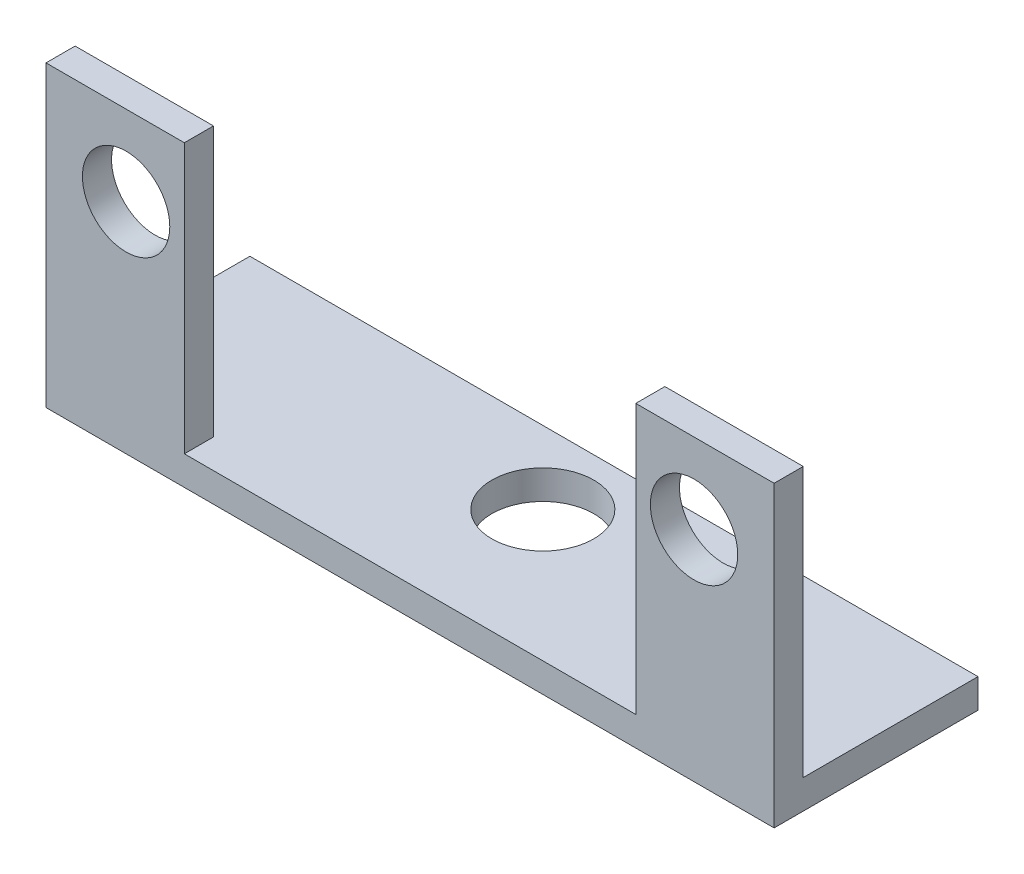
ISO-10303-21;
HEADER;
FILE_DESCRIPTION(('STEP AP214'),'2;1');
FILE_NAME('part.step','',(''),(''),'','','');
FILE_SCHEMA(('AUTOMOTIVE_DESIGN { 1 0 10303 214 1 1 1 1 }'));
ENDSEC;
DATA;
#1=APPLICATION_CONTEXT('core data for automotive mechanical design processes');
#2=APPLICATION_PROTOCOL_DEFINITION('international standard','automotive_design',2000,#1);
#3=PRODUCT_CONTEXT('',#1,'mechanical');
#4=PRODUCT('Part','Part','',(#3));
#5=PRODUCT_RELATED_PRODUCT_CATEGORY('part','',(#4));
#6=PRODUCT_DEFINITION_FORMATION('','',#4);
#7=PRODUCT_DEFINITION_CONTEXT('part definition',#1,'design');
#8=PRODUCT_DEFINITION('design','',#6,#7);
#9=PRODUCT_DEFINITION_SHAPE('','',#8);
#10=(LENGTH_UNIT() NAMED_UNIT(*) SI_UNIT(.MILLI.,.METRE.));
#11=(NAMED_UNIT(*) PLANE_ANGLE_UNIT() SI_UNIT($,.RADIAN.));
#12=(NAMED_UNIT(*) SI_UNIT($,.STERADIAN.) SOLID_ANGLE_UNIT());
#13=UNCERTAINTY_MEASURE_WITH_UNIT(LENGTH_MEASURE(1.E-05),#10,'distance_accuracy_value','');
#14=(GEOMETRIC_REPRESENTATION_CONTEXT(3) GLOBAL_UNCERTAINTY_ASSIGNED_CONTEXT((#13)) GLOBAL_UNIT_ASSIGNED_CONTEXT((#10,
#11,#12)) REPRESENTATION_CONTEXT('',''));
#15=CARTESIAN_POINT('',(0.,0.,0.));
#16=DIRECTION('',(0.,0.,1.));
#17=DIRECTION('',(1.,0.,0.));
#18=AXIS2_PLACEMENT_3D('',#15,#16,#17);
#19=CARTESIAN_POINT('',(0.,0.,0.));
#20=DIRECTION('',(0.,0.,1.));
#21=DIRECTION('',(1.,0.,0.));
#22=AXIS2_PLACEMENT_3D('',#19,#20,#21);
#23=PLANE('',#22);
#24=CARTESIAN_POINT('',(-0.18065955140499,2.83145936235665,0.));
#25=DIRECTION('',(0.,0.,1.));
#26=DIRECTION('',(1.,0.,0.));
#27=AXIS2_PLACEMENT_3D('',#24,#25,#26);
#28=CIRCLE('',#27,1.5);
#29=CARTESIAN_POINT('',(1.31934044859501,2.83145936235665,0.));
#30=VERTEX_POINT('',#29);
#31=EDGE_CURVE('E223',#30,#30,#28,.T.);
#32=ORIENTED_EDGE('',*,*,#31,.T.);
#33=EDGE_LOOP('',(#32));
#34=FACE_BOUND('',#33,.T.);
#35=DIRECTION('',(1.,0.,0.));
#36=VECTOR('',#35,1.);
#37=CARTESIAN_POINT('',(22.069340448595,-3.66854063764335,0.));
#38=LINE('',#37,#36);
#39=CARTESIAN_POINT('',(-2.93065955140499,-3.66854063764335,0.));
#40=VERTEX_POINT('',#39);
#41=CARTESIAN_POINT('',(1.81934044859501,-3.66854063764335,0.));
#42=VERTEX_POINT('',#41);
#43=EDGE_CURVE('E50',#40,#42,#38,.T.);
#44=ORIENTED_EDGE('',*,*,#43,.F.);
#45=DIRECTION('',(0.,-1.,0.));
#46=VECTOR('',#45,1.);
#47=CARTESIAN_POINT('',(-2.93065955140499,5.58145936235664,0.));
#48=LINE('',#47,#46);
#49=CARTESIAN_POINT('',(-2.93065955140499,5.58145936235664,0.));
#50=VERTEX_POINT('',#49);
#51=EDGE_CURVE('E151',#50,#40,#48,.T.);
#52=ORIENTED_EDGE('',*,*,#51,.F.);
#53=DIRECTION('',(-1.,0.,0.));
#54=VECTOR('',#53,1.);
#55=CARTESIAN_POINT('',(1.81934044859501,5.58145936235665,0.));
#56=LINE('',#55,#54);
#57=CARTESIAN_POINT('',(1.81934044859501,5.58145936235665,0.));
#58=VERTEX_POINT('',#57);
#59=EDGE_CURVE('E147',#58,#50,#56,.T.);
#60=ORIENTED_EDGE('',*,*,#59,.F.);
#61=DIRECTION('',(0.,1.,0.));
#62=VECTOR('',#61,1.);
#63=CARTESIAN_POINT('',(1.81934044859501,-3.66854063764335,0.));
#64=LINE('',#63,#62);
#65=EDGE_CURVE('E89',#42,#58,#64,.T.);
#66=ORIENTED_EDGE('',*,*,#65,.F.);
#67=EDGE_LOOP('',(#44,#52,#60,#66));
#68=FACE_BOUND('',#67,.T.);
#69=ADVANCED_FACE('F39',(#34,#68),#23,.F.);
#70=CARTESIAN_POINT('',(19.319340448595,2.83145936235665,0.));
#71=DIRECTION('',(0.,0.,1.));
#72=DIRECTION('',(1.,0.,0.));
#73=AXIS2_PLACEMENT_3D('',#70,#71,#72);
#74=CIRCLE('',#73,1.5);
#75=CARTESIAN_POINT('',(20.819340448595,2.83145936235665,0.));
#76=VERTEX_POINT('',#75);
#77=EDGE_CURVE('E218',#76,#76,#74,.T.);
#78=ORIENTED_EDGE('',*,*,#77,.T.);
#79=EDGE_LOOP('',(#78));
#80=FACE_BOUND('',#79,.T.);
#81=CARTESIAN_POINT('',(17.319340448595,-3.66854063764335,0.));
#82=VERTEX_POINT('',#81);
#83=CARTESIAN_POINT('',(22.069340448595,-3.66854063764335,0.));
#84=VERTEX_POINT('',#83);
#85=EDGE_CURVE('E11',#82,#84,#38,.T.);
#86=ORIENTED_EDGE('',*,*,#85,.F.);
#87=DIRECTION('',(0.,-1.,0.));
#88=VECTOR('',#87,1.);
#89=CARTESIAN_POINT('',(17.319340448595,5.58145936235665,0.));
#90=LINE('',#89,#88);
#91=CARTESIAN_POINT('',(17.319340448595,5.58145936235665,0.));
#92=VERTEX_POINT('',#91);
#93=EDGE_CURVE('E133',#92,#82,#90,.T.);
#94=ORIENTED_EDGE('',*,*,#93,.F.);
#95=DIRECTION('',(-1.,0.,0.));
#96=VECTOR('',#95,1.);
#97=CARTESIAN_POINT('',(22.069340448595,5.58145936235665,0.));
#98=LINE('',#97,#96);
#99=CARTESIAN_POINT('',(22.069340448595,5.58145936235665,0.));
#100=VERTEX_POINT('',#99);
#101=EDGE_CURVE('E158',#100,#92,#98,.T.);
#102=ORIENTED_EDGE('',*,*,#101,.F.);
#103=DIRECTION('',(0.,1.,0.));
#104=VECTOR('',#103,1.);
#105=CARTESIAN_POINT('',(22.069340448595,-4.66854063764335,0.));
#106=LINE('',#105,#104);
#107=EDGE_CURVE('E155',#84,#100,#106,.T.);
#108=ORIENTED_EDGE('',*,*,#107,.F.);
#109=EDGE_LOOP('',(#86,#94,#102,#108));
#110=FACE_BOUND('',#109,.T.);
#111=ADVANCED_FACE('F272',(#80,#110),#23,.F.);
#112=CARTESIAN_POINT('',(0.,0.,1.));
#113=DIRECTION('',(0.,0.,1.));
#114=DIRECTION('',(1.,0.,0.));
#115=AXIS2_PLACEMENT_3D('',#112,#113,#114);
#116=PLANE('',#115);
#117=CARTESIAN_POINT('',(-0.18065955140499,2.83145936235665,1.));
#118=DIRECTION('',(0.,0.,1.));
#119=DIRECTION('',(1.,0.,0.));
#120=AXIS2_PLACEMENT_3D('',#117,#118,#119);
#121=CIRCLE('',#120,1.5);
#122=CARTESIAN_POINT('',(1.31934044859501,2.83145936235665,1.));
#123=VERTEX_POINT('',#122);
#124=EDGE_CURVE('E152',#123,#123,#121,.T.);
#125=ORIENTED_EDGE('',*,*,#124,.F.);
#126=EDGE_LOOP('',(#125));
#127=FACE_BOUND('',#126,.T.);
#128=DIRECTION('',(-1.,0.,0.));
#129=VECTOR('',#128,1.);
#130=CARTESIAN_POINT('',(1.81934044859501,5.58145936235665,1.));
#131=LINE('',#130,#129);
#132=CARTESIAN_POINT('',(1.81934044859501,5.58145936235665,1.));
#133=VERTEX_POINT('',#132);
#134=CARTESIAN_POINT('',(-2.93065955140499,5.58145936235664,1.));
#135=VERTEX_POINT('',#134);
#136=EDGE_CURVE('E165',#133,#135,#131,.T.);
#137=ORIENTED_EDGE('',*,*,#136,.T.);
#138=DIRECTION('',(0.,-1.,0.));
#139=VECTOR('',#138,1.);
#140=CARTESIAN_POINT('',(-2.93065955140499,5.58145936235664,1.));
#141=LINE('',#140,#139);
#142=CARTESIAN_POINT('',(-2.93065955140499,-4.66854063764335,1.));
#143=VERTEX_POINT('',#142);
#144=EDGE_CURVE('E98',#135,#143,#141,.T.);
#145=ORIENTED_EDGE('',*,*,#144,.T.);
#146=DIRECTION('',(1.,0.,0.));
#147=VECTOR('',#146,1.);
#148=CARTESIAN_POINT('',(-2.93065955140499,-4.66854063764335,1.));
#149=LINE('',#148,#147);
#150=CARTESIAN_POINT('',(22.069340448595,-4.66854063764335,1.));
#151=VERTEX_POINT('',#150);
#152=EDGE_CURVE('E237',#143,#151,#149,.T.);
#153=ORIENTED_EDGE('',*,*,#152,.T.);
#154=DIRECTION('',(0.,1.,0.));
#155=VECTOR('',#154,1.);
#156=CARTESIAN_POINT('',(22.069340448595,-4.66854063764335,1.));
#157=LINE('',#156,#155);
#158=CARTESIAN_POINT('',(22.069340448595,5.58145936235665,1.));
#159=VERTEX_POINT('',#158);
#160=EDGE_CURVE('E240',#151,#159,#157,.T.);
#161=ORIENTED_EDGE('',*,*,#160,.T.);
#162=DIRECTION('',(-1.,0.,0.));
#163=VECTOR('',#162,1.);
#164=CARTESIAN_POINT('',(22.069340448595,5.58145936235665,1.));
#165=LINE('',#164,#163);
#166=CARTESIAN_POINT('',(17.319340448595,5.58145936235665,1.));
#167=VERTEX_POINT('',#166);
#168=EDGE_CURVE('E122',#159,#167,#165,.T.);
#169=ORIENTED_EDGE('',*,*,#168,.T.);
#170=DIRECTION('',(0.,-1.,0.));
#171=VECTOR('',#170,1.);
#172=CARTESIAN_POINT('',(17.319340448595,5.58145936235665,1.));
#173=LINE('',#172,#171);
#174=CARTESIAN_POINT('',(17.319340448595,-3.66854063764335,1.));
#175=VERTEX_POINT('',#174);
#176=EDGE_CURVE('E114',#167,#175,#173,.T.);
#177=ORIENTED_EDGE('',*,*,#176,.T.);
#178=DIRECTION('',(-1.,0.,0.));
#179=VECTOR('',#178,1.);
#180=CARTESIAN_POINT('',(17.319340448595,-3.66854063764335,1.));
#181=LINE('',#180,#179);
#182=CARTESIAN_POINT('',(1.81934044859501,-3.66854063764335,1.));
#183=VERTEX_POINT('',#182);
#184=EDGE_CURVE('E119',#175,#183,#181,.T.);
#185=ORIENTED_EDGE('',*,*,#184,.T.);
#186=DIRECTION('',(0.,1.,0.));
#187=VECTOR('',#186,1.);
#188=CARTESIAN_POINT('',(1.81934044859501,-3.66854063764335,1.));
#189=LINE('',#188,#187);
#190=EDGE_CURVE('E65',#183,#133,#189,.T.);
#191=ORIENTED_EDGE('',*,*,#190,.T.);
#192=EDGE_LOOP('',(#137,#145,#153,#161,#169,#177,#185,#191));
#193=FACE_BOUND('',#192,.T.);
#194=CARTESIAN_POINT('',(19.319340448595,2.83145936235665,1.));
#195=DIRECTION('',(0.,0.,1.));
#196=DIRECTION('',(1.,0.,0.));
#197=AXIS2_PLACEMENT_3D('',#194,#195,#196);
#198=CIRCLE('',#197,1.5);
#199=CARTESIAN_POINT('',(20.819340448595,2.83145936235665,1.));
#200=VERTEX_POINT('',#199);
#201=EDGE_CURVE('E219',#200,#200,#198,.T.);
#202=ORIENTED_EDGE('',*,*,#201,.F.);
#203=EDGE_LOOP('',(#202));
#204=FACE_BOUND('',#203,.T.);
#205=ADVANCED_FACE('F116',(#127,#193,#204),#116,.T.);
#206=CARTESIAN_POINT('',(1.81934044859501,5.58145936235665,1.));
#207=DIRECTION('',(0.,-1.,0.));
#208=DIRECTION('',(1.,0.,0.));
#209=AXIS2_PLACEMENT_3D('',#206,#207,#208);
#210=PLANE('',#209);
#211=ORIENTED_EDGE('',*,*,#59,.T.);
#212=DIRECTION('',(0.,0.,-1.));
#213=VECTOR('',#212,1.);
#214=CARTESIAN_POINT('',(-2.93065955140499,5.58145936235664,1.));
#215=LINE('',#214,#213);
#216=EDGE_CURVE('E43',#135,#50,#215,.T.);
#217=ORIENTED_EDGE('',*,*,#216,.F.);
#218=ORIENTED_EDGE('',*,*,#136,.F.);
#219=DIRECTION('',(0.,0.,-1.));
#220=VECTOR('',#219,1.);
#221=CARTESIAN_POINT('',(1.81934044859501,5.58145936235665,1.));
#222=LINE('',#221,#220);
#223=EDGE_CURVE('E143',#133,#58,#222,.T.);
#224=ORIENTED_EDGE('',*,*,#223,.T.);
#225=EDGE_LOOP('',(#211,#217,#218,#224));
#226=FACE_BOUND('',#225,.T.);
#227=ADVANCED_FACE('F41',(#226),#210,.F.);
#228=CARTESIAN_POINT('',(-2.93065955140499,5.58145936235664,1.));
#229=DIRECTION('',(1.,0.,0.));
#230=DIRECTION('',(0.,1.,0.));
#231=AXIS2_PLACEMENT_3D('',#228,#229,#230);
#232=PLANE('',#231);
#233=ORIENTED_EDGE('',*,*,#51,.T.);
#234=DIRECTION('',(0.,0.,1.));
#235=VECTOR('',#234,1.);
#236=CARTESIAN_POINT('',(-2.93065955140499,-3.66854063764335,-6.));
#237=LINE('',#236,#235);
#238=CARTESIAN_POINT('',(-2.93065955140499,-3.66854063764335,-6.));
#239=VERTEX_POINT('',#238);
#240=EDGE_CURVE('E196',#239,#40,#237,.T.);
#241=ORIENTED_EDGE('',*,*,#240,.F.);
#242=DIRECTION('',(0.,1.,0.));
#243=VECTOR('',#242,1.);
#244=CARTESIAN_POINT('',(-2.93065955140499,-4.66854063764335,-6.));
#245=LINE('',#244,#243);
#246=CARTESIAN_POINT('',(-2.93065955140499,-4.66854063764335,-6.));
#247=VERTEX_POINT('',#246);
#248=EDGE_CURVE('E246',#247,#239,#245,.T.);
#249=ORIENTED_EDGE('',*,*,#248,.F.);
#250=DIRECTION('',(0.,0.,-1.));
#251=VECTOR('',#250,1.);
#252=CARTESIAN_POINT('',(-2.93065955140499,-4.66854063764335,1.));
#253=LINE('',#252,#251);
#254=EDGE_CURVE('E179',#143,#247,#253,.T.);
#255=ORIENTED_EDGE('',*,*,#254,.F.);
#256=ORIENTED_EDGE('',*,*,#144,.F.);
#257=ORIENTED_EDGE('',*,*,#216,.T.);
#258=EDGE_LOOP('',(#233,#241,#249,#255,#256,#257));
#259=FACE_BOUND('',#258,.T.);
#260=ADVANCED_FACE('F189',(#259),#232,.F.);
#261=CARTESIAN_POINT('',(-2.93065955140499,-4.66854063764335,1.));
#262=DIRECTION('',(0.,1.,0.));
#263=DIRECTION('',(-1.,0.,0.));
#264=AXIS2_PLACEMENT_3D('',#261,#262,#263);
#265=PLANE('',#264);
#266=CARTESIAN_POINT('',(9.62794513319409,-4.66854063764335,-3.5));
#267=DIRECTION('',(0.,1.,0.));
#268=DIRECTION('',(-1.,0.,0.));
#269=AXIS2_PLACEMENT_3D('',#266,#267,#268);
#270=CIRCLE('',#269,1.75);
#271=CARTESIAN_POINT('',(7.87794513319409,-4.66854063764335,-3.5));
#272=VERTEX_POINT('',#271);
#273=EDGE_CURVE('E199',#272,#272,#270,.T.);
#274=ORIENTED_EDGE('',*,*,#273,.T.);
#275=EDGE_LOOP('',(#274));
#276=FACE_BOUND('',#275,.T.);
#277=ORIENTED_EDGE('',*,*,#254,.T.);
#278=DIRECTION('',(-1.,0.,0.));
#279=VECTOR('',#278,1.);
#280=CARTESIAN_POINT('',(22.069340448595,-4.66854063764335,-6.));
#281=LINE('',#280,#279);
#282=CARTESIAN_POINT('',(22.069340448595,-4.66854063764335,-6.));
#283=VERTEX_POINT('',#282);
#284=EDGE_CURVE('E203',#283,#247,#281,.T.);
#285=ORIENTED_EDGE('',*,*,#284,.F.);
#286=DIRECTION('',(0.,0.,-1.));
#287=VECTOR('',#286,1.);
#288=CARTESIAN_POINT('',(22.069340448595,-4.66854063764335,1.));
#289=LINE('',#288,#287);
#290=EDGE_CURVE('E176',#151,#283,#289,.T.);
#291=ORIENTED_EDGE('',*,*,#290,.F.);
#292=ORIENTED_EDGE('',*,*,#152,.F.);
#293=EDGE_LOOP('',(#277,#285,#291,#292));
#294=FACE_BOUND('',#293,.T.);
#295=ADVANCED_FACE('F333',(#276,#294),#265,.F.);
#296=CARTESIAN_POINT('',(22.069340448595,-4.66854063764335,1.));
#297=DIRECTION('',(-1.,0.,0.));
#298=DIRECTION('',(0.,0.,1.));
#299=AXIS2_PLACEMENT_3D('',#296,#297,#298);
#300=PLANE('',#299);
#301=ORIENTED_EDGE('',*,*,#290,.T.);
#302=DIRECTION('',(0.,-1.,0.));
#303=VECTOR('',#302,1.);
#304=CARTESIAN_POINT('',(22.069340448595,-4.66854063764335,-6.));
#305=LINE('',#304,#303);
#306=CARTESIAN_POINT('',(22.069340448595,-3.66854063764335,-6.));
#307=VERTEX_POINT('',#306);
#308=EDGE_CURVE('E198',#307,#283,#305,.T.);
#309=ORIENTED_EDGE('',*,*,#308,.F.);
#310=DIRECTION('',(0.,0.,1.));
#311=VECTOR('',#310,1.);
#312=CARTESIAN_POINT('',(22.069340448595,-3.66854063764335,-6.));
#313=LINE('',#312,#311);
#314=EDGE_CURVE('E212',#307,#84,#313,.T.);
#315=ORIENTED_EDGE('',*,*,#314,.T.);
#316=ORIENTED_EDGE('',*,*,#107,.T.);
#317=DIRECTION('',(0.,0.,-1.));
#318=VECTOR('',#317,1.);
#319=CARTESIAN_POINT('',(22.069340448595,5.58145936235665,1.));
#320=LINE('',#319,#318);
#321=EDGE_CURVE('E172',#159,#100,#320,.T.);
#322=ORIENTED_EDGE('',*,*,#321,.F.);
#323=ORIENTED_EDGE('',*,*,#160,.F.);
#324=EDGE_LOOP('',(#301,#309,#315,#316,#322,#323));
#325=FACE_BOUND('',#324,.T.);
#326=ADVANCED_FACE('F328',(#325),#300,.F.);
#327=CARTESIAN_POINT('',(22.069340448595,5.58145936235665,1.));
#328=DIRECTION('',(0.,-1.,0.));
#329=DIRECTION('',(1.,0.,0.));
#330=AXIS2_PLACEMENT_3D('',#327,#328,#329);
#331=PLANE('',#330);
#332=ORIENTED_EDGE('',*,*,#101,.T.);
#333=DIRECTION('',(0.,0.,-1.));
#334=VECTOR('',#333,1.);
#335=CARTESIAN_POINT('',(17.319340448595,5.58145936235665,1.));
#336=LINE('',#335,#334);
#337=EDGE_CURVE('E136',#167,#92,#336,.T.);
#338=ORIENTED_EDGE('',*,*,#337,.F.);
#339=ORIENTED_EDGE('',*,*,#168,.F.);
#340=ORIENTED_EDGE('',*,*,#321,.T.);
#341=EDGE_LOOP('',(#332,#338,#339,#340));
#342=FACE_BOUND('',#341,.T.);
#343=ADVANCED_FACE('F269',(#342),#331,.F.);
#344=CARTESIAN_POINT('',(17.319340448595,5.58145936235665,1.));
#345=DIRECTION('',(1.,0.,0.));
#346=DIRECTION('',(0.,0.,-1.));
#347=AXIS2_PLACEMENT_3D('',#344,#345,#346);
#348=PLANE('',#347);
#349=ORIENTED_EDGE('',*,*,#93,.T.);
#350=DIRECTION('',(0.,0.,-1.));
#351=VECTOR('',#350,1.);
#352=CARTESIAN_POINT('',(17.319340448595,-3.66854063764335,1.));
#353=LINE('',#352,#351);
#354=EDGE_CURVE('E130',#175,#82,#353,.T.);
#355=ORIENTED_EDGE('',*,*,#354,.F.);
#356=ORIENTED_EDGE('',*,*,#176,.F.);
#357=ORIENTED_EDGE('',*,*,#337,.T.);
#358=EDGE_LOOP('',(#349,#355,#356,#357));
#359=FACE_BOUND('',#358,.T.);
#360=ADVANCED_FACE('F131',(#359),#348,.F.);
#361=CARTESIAN_POINT('',(17.319340448595,-3.66854063764335,1.));
#362=DIRECTION('',(0.,-1.,0.));
#363=DIRECTION('',(1.,0.,0.));
#364=AXIS2_PLACEMENT_3D('',#361,#362,#363);
#365=PLANE('',#364);
#366=CARTESIAN_POINT('',(9.62794513319409,-3.66854063764335,-3.5));
#367=DIRECTION('',(0.,1.,0.));
#368=DIRECTION('',(-1.,0.,0.));
#369=AXIS2_PLACEMENT_3D('',#366,#367,#368);
#370=CIRCLE('',#369,1.75);
#371=CARTESIAN_POINT('',(7.87794513319409,-3.66854063764335,-3.5));
#372=VERTEX_POINT('',#371);
#373=EDGE_CURVE('E206',#372,#372,#370,.T.);
#374=ORIENTED_EDGE('',*,*,#373,.F.);
#375=EDGE_LOOP('',(#374));
#376=FACE_BOUND('',#375,.T.);
#377=ORIENTED_EDGE('',*,*,#354,.T.);
#378=ORIENTED_EDGE('',*,*,#85,.T.);
#379=ORIENTED_EDGE('',*,*,#314,.F.);
#380=DIRECTION('',(1.,0.,0.));
#381=VECTOR('',#380,1.);
#382=CARTESIAN_POINT('',(22.069340448595,-3.66854063764335,-6.));
#383=LINE('',#382,#381);
#384=EDGE_CURVE('E210',#239,#307,#383,.T.);
#385=ORIENTED_EDGE('',*,*,#384,.F.);
#386=ORIENTED_EDGE('',*,*,#240,.T.);
#387=ORIENTED_EDGE('',*,*,#43,.T.);
#388=DIRECTION('',(0.,0.,-1.));
#389=VECTOR('',#388,1.);
#390=CARTESIAN_POINT('',(1.81934044859501,-3.66854063764335,1.));
#391=LINE('',#390,#389);
#392=EDGE_CURVE('E137',#183,#42,#391,.T.);
#393=ORIENTED_EDGE('',*,*,#392,.F.);
#394=ORIENTED_EDGE('',*,*,#184,.F.);
#395=EDGE_LOOP('',(#377,#378,#379,#385,#386,#387,#393,#394));
#396=FACE_BOUND('',#395,.T.);
#397=ADVANCED_FACE('F139',(#376,#396),#365,.F.);
#398=CARTESIAN_POINT('',(1.81934044859501,-3.66854063764335,1.));
#399=DIRECTION('',(-1.,0.,0.));
#400=DIRECTION('',(0.,-1.,0.));
#401=AXIS2_PLACEMENT_3D('',#398,#399,#400);
#402=PLANE('',#401);
#403=ORIENTED_EDGE('',*,*,#65,.T.);
#404=ORIENTED_EDGE('',*,*,#223,.F.);
#405=ORIENTED_EDGE('',*,*,#190,.F.);
#406=ORIENTED_EDGE('',*,*,#392,.T.);
#407=EDGE_LOOP('',(#403,#404,#405,#406));
#408=FACE_BOUND('',#407,.T.);
#409=ADVANCED_FACE('F261',(#408),#402,.F.);
#410=CARTESIAN_POINT('',(-0.18065955140499,2.83145936235665,1.));
#411=DIRECTION('',(0.,0.,-1.));
#412=DIRECTION('',(-1.,0.,0.));
#413=AXIS2_PLACEMENT_3D('',#410,#411,#412);
#414=CYLINDRICAL_SURFACE('',#413,1.5);
#415=ORIENTED_EDGE('',*,*,#124,.T.);
#416=EDGE_LOOP('',(#415));
#417=FACE_BOUND('',#416,.T.);
#418=ORIENTED_EDGE('',*,*,#31,.F.);
#419=EDGE_LOOP('',(#418));
#420=FACE_BOUND('',#419,.T.);
#421=ADVANCED_FACE('F267',(#417,#420),#414,.F.);
#422=CARTESIAN_POINT('',(19.319340448595,2.83145936235665,1.));
#423=DIRECTION('',(0.,0.,-1.));
#424=DIRECTION('',(-1.,0.,0.));
#425=AXIS2_PLACEMENT_3D('',#422,#423,#424);
#426=CYLINDRICAL_SURFACE('',#425,1.5);
#427=ORIENTED_EDGE('',*,*,#201,.T.);
#428=EDGE_LOOP('',(#427));
#429=FACE_BOUND('',#428,.T.);
#430=ORIENTED_EDGE('',*,*,#77,.F.);
#431=EDGE_LOOP('',(#430));
#432=FACE_BOUND('',#431,.T.);
#433=ADVANCED_FACE('F285',(#429,#432),#426,.F.);
#434=CARTESIAN_POINT('',(0.,0.,-6.));
#435=DIRECTION('',(0.,0.,1.));
#436=DIRECTION('',(1.,0.,0.));
#437=AXIS2_PLACEMENT_3D('',#434,#435,#436);
#438=PLANE('',#437);
#439=ORIENTED_EDGE('',*,*,#308,.T.);
#440=ORIENTED_EDGE('',*,*,#284,.T.);
#441=ORIENTED_EDGE('',*,*,#248,.T.);
#442=ORIENTED_EDGE('',*,*,#384,.T.);
#443=EDGE_LOOP('',(#439,#440,#441,#442));
#444=FACE_BOUND('',#443,.T.);
#445=ADVANCED_FACE('F289',(#444),#438,.F.);
#446=CARTESIAN_POINT('',(9.62794513319409,-8.66854063764335,-3.5));
#447=DIRECTION('',(0.,1.,0.));
#448=DIRECTION('',(-1.,0.,0.));
#449=AXIS2_PLACEMENT_3D('',#446,#447,#448);
#450=CYLINDRICAL_SURFACE('',#449,1.75);
#451=ORIENTED_EDGE('',*,*,#373,.T.);
#452=EDGE_LOOP('',(#451));
#453=FACE_BOUND('',#452,.T.);
#454=ORIENTED_EDGE('',*,*,#273,.F.);
#455=EDGE_LOOP('',(#454));
#456=FACE_BOUND('',#455,.T.);
#457=ADVANCED_FACE('F257',(#453,#456),#450,.F.);
#458=CLOSED_SHELL('',(#69,#111,#205,#227,#260,#295,#326,#343,#360,#397,#409,#421,#433,#445,#457));
#459=MANIFOLD_SOLID_BREP('B2',#458);
#460=ADVANCED_BREP_SHAPE_REPRESENTATION('',(#18,#459),#14);
#461=SHAPE_DEFINITION_REPRESENTATION(#9,#460);
ENDSEC;
END-ISO-10303-21;
